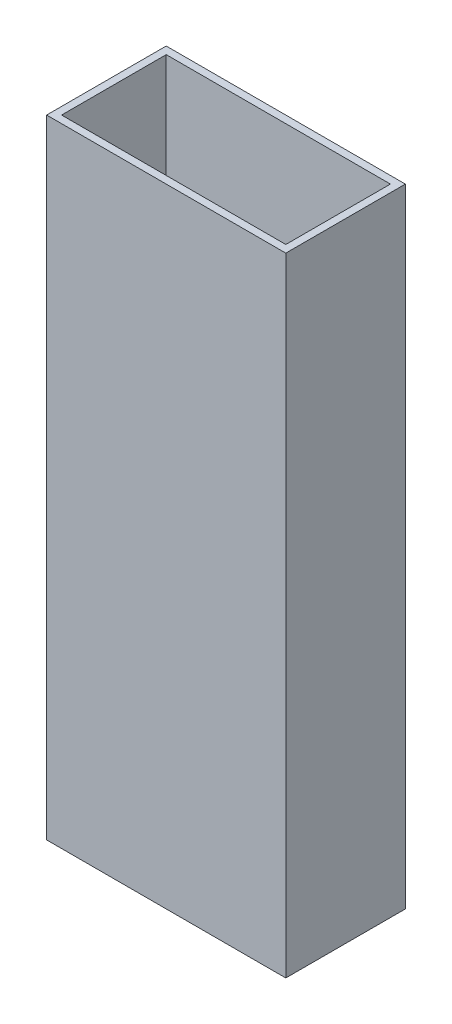
ISO-10303-21;
HEADER;
FILE_DESCRIPTION(('STEP AP214'),'2;1');
FILE_NAME('part.step','',(''),(''),'','','');
FILE_SCHEMA(('AUTOMOTIVE_DESIGN { 1 0 10303 214 1 1 1 1 }'));
ENDSEC;
DATA;
#1=APPLICATION_CONTEXT('core data for automotive mechanical design processes');
#2=APPLICATION_PROTOCOL_DEFINITION('international standard','automotive_design',2000,#1);
#3=PRODUCT_CONTEXT('',#1,'mechanical');
#4=PRODUCT('Part','Part','',(#3));
#5=PRODUCT_RELATED_PRODUCT_CATEGORY('part','',(#4));
#6=PRODUCT_DEFINITION_FORMATION('','',#4);
#7=PRODUCT_DEFINITION_CONTEXT('part definition',#1,'design');
#8=PRODUCT_DEFINITION('design','',#6,#7);
#9=PRODUCT_DEFINITION_SHAPE('','',#8);
#10=(LENGTH_UNIT() NAMED_UNIT(*) SI_UNIT(.MILLI.,.METRE.));
#11=(NAMED_UNIT(*) PLANE_ANGLE_UNIT() SI_UNIT($,.RADIAN.));
#12=(NAMED_UNIT(*) SI_UNIT($,.STERADIAN.) SOLID_ANGLE_UNIT());
#13=UNCERTAINTY_MEASURE_WITH_UNIT(LENGTH_MEASURE(1.E-05),#10,'distance_accuracy_value','');
#14=(GEOMETRIC_REPRESENTATION_CONTEXT(3) GLOBAL_UNCERTAINTY_ASSIGNED_CONTEXT((#13)) GLOBAL_UNIT_ASSIGNED_CONTEXT((#10,
#11,#12)) REPRESENTATION_CONTEXT('',''));
#15=CARTESIAN_POINT('',(0.,0.,0.));
#16=DIRECTION('',(0.,0.,1.));
#17=DIRECTION('',(1.,0.,0.));
#18=AXIS2_PLACEMENT_3D('',#15,#16,#17);
#19=CARTESIAN_POINT('',(0.,133.35,0.));
#20=DIRECTION('',(0.,1.,0.));
#21=DIRECTION('',(0.,0.,1.));
#22=AXIS2_PLACEMENT_3D('',#19,#20,#21);
#23=PLANE('',#22);
#24=DIRECTION('',(0.,0.,1.));
#25=VECTOR('',#24,1.);
#26=CARTESIAN_POINT('',(-18.4198473282443,133.35,-12.506106870229));
#27=LINE('',#26,#25);
#28=CARTESIAN_POINT('',(-18.4198473282443,133.35,-12.506106870229));
#29=VERTEX_POINT('',#28);
#30=CARTESIAN_POINT('',(-18.4198473282443,133.35,12.893893129771));
#31=VERTEX_POINT('',#30);
#32=EDGE_CURVE('E153',#29,#31,#27,.T.);
#33=ORIENTED_EDGE('',*,*,#32,.T.);
#34=DIRECTION('',(1.,0.,0.));
#35=VECTOR('',#34,1.);
#36=CARTESIAN_POINT('',(-18.4198473282443,133.35,12.893893129771));
#37=LINE('',#36,#35);
#38=CARTESIAN_POINT('',(32.3801526717557,133.35,12.893893129771));
#39=VERTEX_POINT('',#38);
#40=EDGE_CURVE('E157',#31,#39,#37,.T.);
#41=ORIENTED_EDGE('',*,*,#40,.T.);
#42=DIRECTION('',(0.,0.,-1.));
#43=VECTOR('',#42,1.);
#44=CARTESIAN_POINT('',(32.3801526717557,133.35,-12.506106870229));
#45=LINE('',#44,#43);
#46=CARTESIAN_POINT('',(32.3801526717557,133.35,-12.506106870229));
#47=VERTEX_POINT('',#46);
#48=EDGE_CURVE('E161',#39,#47,#45,.T.);
#49=ORIENTED_EDGE('',*,*,#48,.T.);
#50=DIRECTION('',(-1.,0.,0.));
#51=VECTOR('',#50,1.);
#52=CARTESIAN_POINT('',(-18.4198473282443,133.35,-12.506106870229));
#53=LINE('',#52,#51);
#54=EDGE_CURVE('E164',#47,#29,#53,.T.);
#55=ORIENTED_EDGE('',*,*,#54,.T.);
#56=EDGE_LOOP('',(#33,#41,#49,#55));
#57=FACE_BOUND('',#56,.T.);
#58=DIRECTION('',(1.,0.,0.));
#59=VECTOR('',#58,1.);
#60=CARTESIAN_POINT('',(-16.8323473282443,133.35,11.306393129771));
#61=LINE('',#60,#59);
#62=CARTESIAN_POINT('',(-16.8323473282443,133.35,11.306393129771));
#63=VERTEX_POINT('',#62);
#64=CARTESIAN_POINT('',(30.7926526717557,133.35,11.306393129771));
#65=VERTEX_POINT('',#64);
#66=EDGE_CURVE('E114',#63,#65,#61,.T.);
#67=ORIENTED_EDGE('',*,*,#66,.F.);
#68=DIRECTION('',(0.,0.,1.));
#69=VECTOR('',#68,1.);
#70=CARTESIAN_POINT('',(-16.8323473282443,133.35,-10.918606870229));
#71=LINE('',#70,#69);
#72=CARTESIAN_POINT('',(-16.8323473282443,133.35,-10.918606870229));
#73=VERTEX_POINT('',#72);
#74=EDGE_CURVE('E105',#73,#63,#71,.T.);
#75=ORIENTED_EDGE('',*,*,#74,.F.);
#76=DIRECTION('',(-1.,0.,0.));
#77=VECTOR('',#76,1.);
#78=CARTESIAN_POINT('',(-16.8323473282443,133.35,-10.918606870229));
#79=LINE('',#78,#77);
#80=CARTESIAN_POINT('',(30.7926526717557,133.35,-10.918606870229));
#81=VERTEX_POINT('',#80);
#82=EDGE_CURVE('E131',#81,#73,#79,.T.);
#83=ORIENTED_EDGE('',*,*,#82,.F.);
#84=DIRECTION('',(0.,0.,-1.));
#85=VECTOR('',#84,1.);
#86=CARTESIAN_POINT('',(30.7926526717557,133.35,-10.918606870229));
#87=LINE('',#86,#85);
#88=EDGE_CURVE('E127',#65,#81,#87,.T.);
#89=ORIENTED_EDGE('',*,*,#88,.F.);
#90=EDGE_LOOP('',(#67,#75,#83,#89));
#91=FACE_BOUND('',#90,.T.);
#92=ADVANCED_FACE('F39',(#57,#91),#23,.T.);
#93=CARTESIAN_POINT('',(0.,0.,0.));
#94=DIRECTION('',(0.,1.,0.));
#95=DIRECTION('',(0.,0.,1.));
#96=AXIS2_PLACEMENT_3D('',#93,#94,#95);
#97=PLANE('',#96);
#98=DIRECTION('',(0.,0.,1.));
#99=VECTOR('',#98,1.);
#100=CARTESIAN_POINT('',(-18.4198473282443,0.,-12.506106870229));
#101=LINE('',#100,#99);
#102=CARTESIAN_POINT('',(-18.4198473282443,0.,-12.506106870229));
#103=VERTEX_POINT('',#102);
#104=CARTESIAN_POINT('',(-18.4198473282443,0.,12.893893129771));
#105=VERTEX_POINT('',#104);
#106=EDGE_CURVE('E123',#103,#105,#101,.T.);
#107=ORIENTED_EDGE('',*,*,#106,.F.);
#108=DIRECTION('',(-1.,0.,0.));
#109=VECTOR('',#108,1.);
#110=CARTESIAN_POINT('',(-18.4198473282443,0.,-12.506106870229));
#111=LINE('',#110,#109);
#112=CARTESIAN_POINT('',(32.3801526717557,0.,-12.506106870229));
#113=VERTEX_POINT('',#112);
#114=EDGE_CURVE('E158',#113,#103,#111,.T.);
#115=ORIENTED_EDGE('',*,*,#114,.F.);
#116=DIRECTION('',(0.,0.,-1.));
#117=VECTOR('',#116,1.);
#118=CARTESIAN_POINT('',(32.3801526717557,0.,-12.506106870229));
#119=LINE('',#118,#117);
#120=CARTESIAN_POINT('',(32.3801526717557,0.,12.893893129771));
#121=VERTEX_POINT('',#120);
#122=EDGE_CURVE('E174',#121,#113,#119,.T.);
#123=ORIENTED_EDGE('',*,*,#122,.F.);
#124=DIRECTION('',(1.,0.,0.));
#125=VECTOR('',#124,1.);
#126=CARTESIAN_POINT('',(-18.4198473282443,0.,12.893893129771));
#127=LINE('',#126,#125);
#128=EDGE_CURVE('E171',#105,#121,#127,.T.);
#129=ORIENTED_EDGE('',*,*,#128,.F.);
#130=EDGE_LOOP('',(#107,#115,#123,#129));
#131=FACE_BOUND('',#130,.T.);
#132=DIRECTION('',(0.,0.,1.));
#133=VECTOR('',#132,1.);
#134=CARTESIAN_POINT('',(-16.8323473282443,0.,-10.918606870229));
#135=LINE('',#134,#133);
#136=CARTESIAN_POINT('',(-16.8323473282443,0.,-10.918606870229));
#137=VERTEX_POINT('',#136);
#138=CARTESIAN_POINT('',(-16.8323473282443,0.,11.306393129771));
#139=VERTEX_POINT('',#138);
#140=EDGE_CURVE('E63',#137,#139,#135,.T.);
#141=ORIENTED_EDGE('',*,*,#140,.T.);
#142=DIRECTION('',(1.,0.,0.));
#143=VECTOR('',#142,1.);
#144=CARTESIAN_POINT('',(-16.8323473282443,0.,11.306393129771));
#145=LINE('',#144,#143);
#146=CARTESIAN_POINT('',(30.7926526717557,0.,11.306393129771));
#147=VERTEX_POINT('',#146);
#148=EDGE_CURVE('E121',#139,#147,#145,.T.);
#149=ORIENTED_EDGE('',*,*,#148,.T.);
#150=DIRECTION('',(0.,0.,-1.));
#151=VECTOR('',#150,1.);
#152=CARTESIAN_POINT('',(30.7926526717557,0.,-10.918606870229));
#153=LINE('',#152,#151);
#154=CARTESIAN_POINT('',(30.7926526717557,0.,-10.918606870229));
#155=VERTEX_POINT('',#154);
#156=EDGE_CURVE('E140',#147,#155,#153,.T.);
#157=ORIENTED_EDGE('',*,*,#156,.T.);
#158=DIRECTION('',(-1.,0.,0.));
#159=VECTOR('',#158,1.);
#160=CARTESIAN_POINT('',(-16.8323473282443,0.,-10.918606870229));
#161=LINE('',#160,#159);
#162=EDGE_CURVE('E115',#155,#137,#161,.T.);
#163=ORIENTED_EDGE('',*,*,#162,.T.);
#164=EDGE_LOOP('',(#141,#149,#157,#163));
#165=FACE_BOUND('',#164,.T.);
#166=ADVANCED_FACE('F197',(#131,#165),#97,.F.);
#167=CARTESIAN_POINT('',(-18.4198473282443,133.35,-12.506106870229));
#168=DIRECTION('',(1.,0.,0.));
#169=DIRECTION('',(0.,0.,-1.));
#170=AXIS2_PLACEMENT_3D('',#167,#168,#169);
#171=PLANE('',#170);
#172=ORIENTED_EDGE('',*,*,#106,.T.);
#173=DIRECTION('',(0.,-1.,0.));
#174=VECTOR('',#173,1.);
#175=CARTESIAN_POINT('',(-18.4198473282443,133.35,12.893893129771));
#176=LINE('',#175,#174);
#177=EDGE_CURVE('E11',#31,#105,#176,.T.);
#178=ORIENTED_EDGE('',*,*,#177,.F.);
#179=ORIENTED_EDGE('',*,*,#32,.F.);
#180=DIRECTION('',(0.,-1.,0.));
#181=VECTOR('',#180,1.);
#182=CARTESIAN_POINT('',(-18.4198473282443,133.35,-12.506106870229));
#183=LINE('',#182,#181);
#184=EDGE_CURVE('E167',#29,#103,#183,.T.);
#185=ORIENTED_EDGE('',*,*,#184,.T.);
#186=EDGE_LOOP('',(#172,#178,#179,#185));
#187=FACE_BOUND('',#186,.T.);
#188=ADVANCED_FACE('F41',(#187),#171,.F.);
#189=CARTESIAN_POINT('',(-18.4198473282443,133.35,12.893893129771));
#190=DIRECTION('',(0.,0.,-1.));
#191=DIRECTION('',(-1.,0.,0.));
#192=AXIS2_PLACEMENT_3D('',#189,#190,#191);
#193=PLANE('',#192);
#194=ORIENTED_EDGE('',*,*,#128,.T.);
#195=DIRECTION('',(0.,-1.,0.));
#196=VECTOR('',#195,1.);
#197=CARTESIAN_POINT('',(32.3801526717557,133.35,12.893893129771));
#198=LINE('',#197,#196);
#199=EDGE_CURVE('E48',#39,#121,#198,.T.);
#200=ORIENTED_EDGE('',*,*,#199,.F.);
#201=ORIENTED_EDGE('',*,*,#40,.F.);
#202=ORIENTED_EDGE('',*,*,#177,.T.);
#203=EDGE_LOOP('',(#194,#200,#201,#202));
#204=FACE_BOUND('',#203,.T.);
#205=ADVANCED_FACE('F207',(#204),#193,.F.);
#206=CARTESIAN_POINT('',(32.3801526717557,133.35,-12.506106870229));
#207=DIRECTION('',(-1.,0.,0.));
#208=DIRECTION('',(0.,0.,1.));
#209=AXIS2_PLACEMENT_3D('',#206,#207,#208);
#210=PLANE('',#209);
#211=ORIENTED_EDGE('',*,*,#122,.T.);
#212=DIRECTION('',(0.,-1.,0.));
#213=VECTOR('',#212,1.);
#214=CARTESIAN_POINT('',(32.3801526717557,133.35,-12.506106870229));
#215=LINE('',#214,#213);
#216=EDGE_CURVE('E182',#47,#113,#215,.T.);
#217=ORIENTED_EDGE('',*,*,#216,.F.);
#218=ORIENTED_EDGE('',*,*,#48,.F.);
#219=ORIENTED_EDGE('',*,*,#199,.T.);
#220=EDGE_LOOP('',(#211,#217,#218,#219));
#221=FACE_BOUND('',#220,.T.);
#222=ADVANCED_FACE('F191',(#221),#210,.F.);
#223=CARTESIAN_POINT('',(-18.4198473282443,133.35,-12.506106870229));
#224=DIRECTION('',(0.,0.,1.));
#225=DIRECTION('',(1.,0.,0.));
#226=AXIS2_PLACEMENT_3D('',#223,#224,#225);
#227=PLANE('',#226);
#228=ORIENTED_EDGE('',*,*,#114,.T.);
#229=ORIENTED_EDGE('',*,*,#184,.F.);
#230=ORIENTED_EDGE('',*,*,#54,.F.);
#231=ORIENTED_EDGE('',*,*,#216,.T.);
#232=EDGE_LOOP('',(#228,#229,#230,#231));
#233=FACE_BOUND('',#232,.T.);
#234=ADVANCED_FACE('F201',(#233),#227,.F.);
#235=CARTESIAN_POINT('',(-16.8323473282443,133.35,-10.918606870229));
#236=DIRECTION('',(1.,0.,0.));
#237=DIRECTION('',(0.,0.,-1.));
#238=AXIS2_PLACEMENT_3D('',#235,#236,#237);
#239=PLANE('',#238);
#240=ORIENTED_EDGE('',*,*,#140,.F.);
#241=DIRECTION('',(0.,-1.,0.));
#242=VECTOR('',#241,1.);
#243=CARTESIAN_POINT('',(-16.8323473282443,133.35,-10.918606870229));
#244=LINE('',#243,#242);
#245=EDGE_CURVE('E109',#73,#137,#244,.T.);
#246=ORIENTED_EDGE('',*,*,#245,.F.);
#247=ORIENTED_EDGE('',*,*,#74,.T.);
#248=DIRECTION('',(0.,-1.,0.));
#249=VECTOR('',#248,1.);
#250=CARTESIAN_POINT('',(-16.8323473282443,133.35,11.306393129771));
#251=LINE('',#250,#249);
#252=EDGE_CURVE('E108',#63,#139,#251,.T.);
#253=ORIENTED_EDGE('',*,*,#252,.T.);
#254=EDGE_LOOP('',(#240,#246,#247,#253));
#255=FACE_BOUND('',#254,.T.);
#256=ADVANCED_FACE('F107',(#255),#239,.T.);
#257=CARTESIAN_POINT('',(-16.8323473282443,133.35,11.306393129771));
#258=DIRECTION('',(0.,0.,-1.));
#259=DIRECTION('',(-1.,0.,0.));
#260=AXIS2_PLACEMENT_3D('',#257,#258,#259);
#261=PLANE('',#260);
#262=ORIENTED_EDGE('',*,*,#148,.F.);
#263=ORIENTED_EDGE('',*,*,#252,.F.);
#264=ORIENTED_EDGE('',*,*,#66,.T.);
#265=DIRECTION('',(0.,-1.,0.));
#266=VECTOR('',#265,1.);
#267=CARTESIAN_POINT('',(30.7926526717557,133.35,11.306393129771));
#268=LINE('',#267,#266);
#269=EDGE_CURVE('E124',#65,#147,#268,.T.);
#270=ORIENTED_EDGE('',*,*,#269,.T.);
#271=EDGE_LOOP('',(#262,#263,#264,#270));
#272=FACE_BOUND('',#271,.T.);
#273=ADVANCED_FACE('F118',(#272),#261,.T.);
#274=CARTESIAN_POINT('',(30.7926526717557,133.35,-10.918606870229));
#275=DIRECTION('',(-1.,0.,0.));
#276=DIRECTION('',(0.,0.,1.));
#277=AXIS2_PLACEMENT_3D('',#274,#275,#276);
#278=PLANE('',#277);
#279=ORIENTED_EDGE('',*,*,#156,.F.);
#280=ORIENTED_EDGE('',*,*,#269,.F.);
#281=ORIENTED_EDGE('',*,*,#88,.T.);
#282=DIRECTION('',(0.,-1.,0.));
#283=VECTOR('',#282,1.);
#284=CARTESIAN_POINT('',(30.7926526717557,133.35,-10.918606870229));
#285=LINE('',#284,#283);
#286=EDGE_CURVE('E55',#81,#155,#285,.T.);
#287=ORIENTED_EDGE('',*,*,#286,.T.);
#288=EDGE_LOOP('',(#279,#280,#281,#287));
#289=FACE_BOUND('',#288,.T.);
#290=ADVANCED_FACE('F230',(#289),#278,.T.);
#291=CARTESIAN_POINT('',(-16.8323473282443,133.35,-10.918606870229));
#292=DIRECTION('',(0.,0.,1.));
#293=DIRECTION('',(1.,0.,0.));
#294=AXIS2_PLACEMENT_3D('',#291,#292,#293);
#295=PLANE('',#294);
#296=ORIENTED_EDGE('',*,*,#162,.F.);
#297=ORIENTED_EDGE('',*,*,#286,.F.);
#298=ORIENTED_EDGE('',*,*,#82,.T.);
#299=ORIENTED_EDGE('',*,*,#245,.T.);
#300=EDGE_LOOP('',(#296,#297,#298,#299));
#301=FACE_BOUND('',#300,.T.);
#302=ADVANCED_FACE('F234',(#301),#295,.T.);
#303=CLOSED_SHELL('',(#92,#166,#188,#205,#222,#234,#256,#273,#290,#302));
#304=MANIFOLD_SOLID_BREP('B2',#303);
#305=ADVANCED_BREP_SHAPE_REPRESENTATION('',(#18,#304),#14);
#306=SHAPE_DEFINITION_REPRESENTATION(#9,#305);
ENDSEC;
END-ISO-10303-21;
